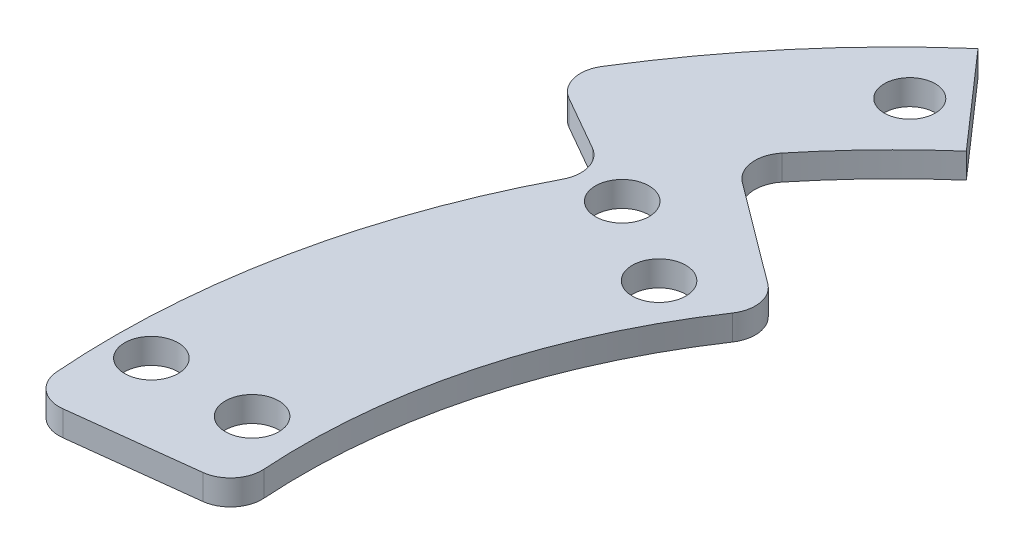
ISO-10303-21;
HEADER;
FILE_DESCRIPTION(('STEP AP214'),'2;1');
FILE_NAME('part.step','',(''),(''),'','','');
FILE_SCHEMA(('AUTOMOTIVE_DESIGN { 1 0 10303 214 1 1 1 1 }'));
ENDSEC;
DATA;
#1=APPLICATION_CONTEXT('core data for automotive mechanical design processes');
#2=APPLICATION_PROTOCOL_DEFINITION('international standard','automotive_design',2000,#1);
#3=PRODUCT_CONTEXT('',#1,'mechanical');
#4=PRODUCT('Part','Part','',(#3));
#5=PRODUCT_RELATED_PRODUCT_CATEGORY('part','',(#4));
#6=PRODUCT_DEFINITION_FORMATION('','',#4);
#7=PRODUCT_DEFINITION_CONTEXT('part definition',#1,'design');
#8=PRODUCT_DEFINITION('design','',#6,#7);
#9=PRODUCT_DEFINITION_SHAPE('','',#8);
#10=(LENGTH_UNIT() NAMED_UNIT(*) SI_UNIT(.MILLI.,.METRE.));
#11=(NAMED_UNIT(*) PLANE_ANGLE_UNIT() SI_UNIT($,.RADIAN.));
#12=(NAMED_UNIT(*) SI_UNIT($,.STERADIAN.) SOLID_ANGLE_UNIT());
#13=UNCERTAINTY_MEASURE_WITH_UNIT(LENGTH_MEASURE(1.E-05),#10,'distance_accuracy_value','');
#14=(GEOMETRIC_REPRESENTATION_CONTEXT(3) GLOBAL_UNCERTAINTY_ASSIGNED_CONTEXT((#13)) GLOBAL_UNIT_ASSIGNED_CONTEXT((#10,
#11,#12)) REPRESENTATION_CONTEXT('',''));
#15=CARTESIAN_POINT('',(0.,0.,0.));
#16=DIRECTION('',(0.,0.,1.));
#17=DIRECTION('',(1.,0.,0.));
#18=AXIS2_PLACEMENT_3D('',#15,#16,#17);
#19=CARTESIAN_POINT('',(-37.6558236064136,2.,-28.1254146373465));
#20=DIRECTION('',(-0.59841307739035,0.,0.801187736306673));
#21=DIRECTION('',(0.801187736306673,0.,0.59841307739035));
#22=AXIS2_PLACEMENT_3D('',#19,#20,#21);
#23=PLANE('',#22);
#24=DIRECTION('',(-0.801187736306673,0.,-0.59841307739035));
#25=VECTOR('',#24,1.);
#26=CARTESIAN_POINT('',(-37.6558236064136,0.,-28.1254146373465));
#27=LINE('',#26,#25);
#28=CARTESIAN_POINT('',(-39.6081806177369,0.,-29.5836446056387));
#29=VERTEX_POINT('',#28);
#30=CARTESIAN_POINT('',(-47.628572534228,0.,-35.5741349628039));
#31=VERTEX_POINT('',#30);
#32=EDGE_CURVE('E216',#29,#31,#27,.T.);
#33=ORIENTED_EDGE('',*,*,#32,.T.);
#34=DIRECTION('',(0.,1.,0.));
#35=VECTOR('',#34,1.);
#36=CARTESIAN_POINT('',(-47.628572534228,2.,-35.5741349628039));
#37=LINE('',#36,#35);
#38=CARTESIAN_POINT('',(-47.628572534228,2.,-35.5741349628039));
#39=VERTEX_POINT('',#38);
#40=EDGE_CURVE('E227',#31,#39,#37,.T.);
#41=ORIENTED_EDGE('',*,*,#40,.T.);
#42=DIRECTION('',(-0.801187736306673,0.,-0.59841307739035));
#43=VECTOR('',#42,1.);
#44=CARTESIAN_POINT('',(-37.6558236064136,2.,-28.1254146373465));
#45=LINE('',#44,#43);
#46=CARTESIAN_POINT('',(-39.6081806177369,2.,-29.5836446056387));
#47=VERTEX_POINT('',#46);
#48=EDGE_CURVE('E206',#47,#39,#45,.T.);
#49=ORIENTED_EDGE('',*,*,#48,.F.);
#50=DIRECTION('',(0.,-1.,0.));
#51=VECTOR('',#50,1.);
#52=CARTESIAN_POINT('',(-39.6081806177369,2.,-29.5836446056387));
#53=LINE('',#52,#51);
#54=EDGE_CURVE('E224',#47,#29,#53,.T.);
#55=ORIENTED_EDGE('',*,*,#54,.T.);
#56=EDGE_LOOP('',(#33,#41,#49,#55));
#57=FACE_BOUND('',#56,.T.);
#58=ADVANCED_FACE('F33',(#57),#23,.F.);
#59=CARTESIAN_POINT('',(0.,2.,0.));
#60=DIRECTION('',(0.,-1.,0.));
#61=DIRECTION('',(0.,0.,-1.));
#62=AXIS2_PLACEMENT_3D('',#59,#60,#61);
#63=CYLINDRICAL_SURFACE('',#62,62.);
#64=CARTESIAN_POINT('',(0.,0.,0.));
#65=DIRECTION('',(0.,1.,0.));
#66=DIRECTION('',(0.,0.,1.));
#67=AXIS2_PLACEMENT_3D('',#64,#65,#66);
#68=CIRCLE('',#67,62.);
#69=CARTESIAN_POINT('',(-54.9771713141222,0.,-28.6620068086248));
#70=VERTEX_POINT('',#69);
#71=CARTESIAN_POINT('',(-61.8215430440958,0.,4.70072501291086));
#72=VERTEX_POINT('',#71);
#73=EDGE_CURVE('E219',#70,#72,#68,.T.);
#74=ORIENTED_EDGE('',*,*,#73,.T.);
#75=DIRECTION('',(0.,-1.,0.));
#76=VECTOR('',#75,1.);
#77=CARTESIAN_POINT('',(-61.8215430440958,2.,4.70072501291086));
#78=LINE('',#77,#76);
#79=CARTESIAN_POINT('',(-61.8215430440958,2.,4.70072501291086));
#80=VERTEX_POINT('',#79);
#81=EDGE_CURVE('E48',#72,#80,#78,.F.);
#82=ORIENTED_EDGE('',*,*,#81,.T.);
#83=CARTESIAN_POINT('',(0.,2.,0.));
#84=DIRECTION('',(0.,1.,0.));
#85=DIRECTION('',(0.,0.,1.));
#86=AXIS2_PLACEMENT_3D('',#83,#84,#85);
#87=CIRCLE('',#86,62.);
#88=CARTESIAN_POINT('',(-54.9771713141222,2.,-28.6620068086248));
#89=VERTEX_POINT('',#88);
#90=EDGE_CURVE('E209',#89,#80,#87,.T.);
#91=ORIENTED_EDGE('',*,*,#90,.F.);
#92=DIRECTION('',(0.,-1.,0.));
#93=VECTOR('',#92,1.);
#94=CARTESIAN_POINT('',(-54.9771713141222,2.,-28.6620068086248));
#95=LINE('',#94,#93);
#96=EDGE_CURVE('E255',#89,#70,#95,.T.);
#97=ORIENTED_EDGE('',*,*,#96,.T.);
#98=EDGE_LOOP('',(#74,#82,#91,#97));
#99=FACE_BOUND('',#98,.T.);
#100=ADVANCED_FACE('F282',(#99),#63,.T.);
#101=CARTESIAN_POINT('',(0.,2.,0.));
#102=DIRECTION('',(0.,1.,0.));
#103=DIRECTION('',(0.,0.,1.));
#104=AXIS2_PLACEMENT_3D('',#101,#102,#103);
#105=PLANE('',#104);
#106=CARTESIAN_POINT('',(-46.7466608615999,2.,-47.9973926197098));
#107=DIRECTION('',(0.,1.,0.));
#108=DIRECTION('',(0.,0.,1.));
#109=AXIS2_PLACEMENT_3D('',#106,#107,#108);
#110=CIRCLE('',#109,2.025);
#111=CARTESIAN_POINT('',(-46.7466608615999,2.,-45.9723926197098));
#112=VERTEX_POINT('',#111);
#113=EDGE_CURVE('E168',#112,#112,#110,.T.);
#114=ORIENTED_EDGE('',*,*,#113,.F.);
#115=EDGE_LOOP('',(#114));
#116=FACE_BOUND('',#115,.T.);
#117=CARTESIAN_POINT('',(-44.1672955930063,2.,-25.5));
#118=DIRECTION('',(0.,1.,0.));
#119=DIRECTION('',(0.,0.,1.));
#120=AXIS2_PLACEMENT_3D('',#117,#118,#119);
#121=CIRCLE('',#120,2.125);
#122=CARTESIAN_POINT('',(-44.1672955930063,2.,-23.375));
#123=VERTEX_POINT('',#122);
#124=EDGE_CURVE('E185',#123,#123,#121,.T.);
#125=ORIENTED_EDGE('',*,*,#124,.F.);
#126=EDGE_LOOP('',(#125));
#127=FACE_BOUND('',#126,.T.);
#128=CARTESIAN_POINT('',(-51.0954988232818,2.,-29.5));
#129=DIRECTION('',(0.,1.,0.));
#130=DIRECTION('',(0.,0.,1.));
#131=AXIS2_PLACEMENT_3D('',#128,#129,#130);
#132=CIRCLE('',#131,2.125);
#133=CARTESIAN_POINT('',(-51.0954988232818,2.,-27.3750000000001));
#134=VERTEX_POINT('',#133);
#135=EDGE_CURVE('E197',#134,#134,#132,.T.);
#136=ORIENTED_EDGE('',*,*,#135,.F.);
#137=EDGE_LOOP('',(#136));
#138=FACE_BOUND('',#137,.T.);
#139=DIRECTION('',(0.993055471537302,0.,-0.117647058823529));
#140=VECTOR('',#139,1.);
#141=CARTESIAN_POINT('',(-46.6736071622532,2.,5.52941176470589));
#142=LINE('',#141,#140);
#143=CARTESIAN_POINT('',(-59.0346212420331,2.,6.99381832833029));
#144=VERTEX_POINT('',#143);
#145=CARTESIAN_POINT('',(-49.0935129154619,2.,5.81609745614508));
#146=VERTEX_POINT('',#145);
#147=EDGE_CURVE('E211',#144,#146,#142,.T.);
#148=ORIENTED_EDGE('',*,*,#147,.T.);
#149=CARTESIAN_POINT('',(-49.3876305625207,2.,3.33345877730183));
#150=DIRECTION('',(0.,1.,0.));
#151=DIRECTION('',(0.,0.,1.));
#152=AXIS2_PLACEMENT_3D('',#149,#150,#151);
#153=CIRCLE('',#152,2.5);
#154=CARTESIAN_POINT('',(-46.8933057866358,2.,3.16510227339769));
#155=VERTEX_POINT('',#154);
#156=EDGE_CURVE('E253',#146,#155,#153,.T.);
#157=ORIENTED_EDGE('',*,*,#156,.T.);
#158=CARTESIAN_POINT('',(0.,2.,0.));
#159=DIRECTION('',(0.,-1.,0.));
#160=DIRECTION('',(0.,0.,1.));
#161=AXIS2_PLACEMENT_3D('',#158,#159,#160);
#162=CIRCLE('',#161,47.);
#163=CARTESIAN_POINT('',(-39.0282429419596,2.,-26.1877118676562));
#164=VERTEX_POINT('',#163);
#165=EDGE_CURVE('E203',#155,#164,#162,.T.);
#166=ORIENTED_EDGE('',*,*,#165,.T.);
#167=CARTESIAN_POINT('',(-41.1042133112127,2.,-27.580675264872));
#168=DIRECTION('',(0.,1.,0.));
#169=DIRECTION('',(0.,0.,1.));
#170=AXIS2_PLACEMENT_3D('',#167,#168,#169);
#171=CIRCLE('',#170,2.5);
#172=EDGE_CURVE('E247',#164,#47,#171,.T.);
#173=ORIENTED_EDGE('',*,*,#172,.T.);
#174=ORIENTED_EDGE('',*,*,#48,.T.);
#175=CARTESIAN_POINT('',(-46.1325398407521,2.,-37.5771043035706));
#176=DIRECTION('',(0.,1.,0.));
#177=DIRECTION('',(0.,0.,1.));
#178=AXIS2_PLACEMENT_3D('',#175,#176,#177);
#179=CIRCLE('',#178,2.5);
#180=CARTESIAN_POINT('',(-48.0708818508677,2.,-39.155974232292));
#181=VERTEX_POINT('',#180);
#182=EDGE_CURVE('E143',#39,#181,#179,.F.);
#183=ORIENTED_EDGE('',*,*,#182,.T.);
#184=CARTESIAN_POINT('',(0.,2.,0.));
#185=DIRECTION('',(0.,1.,0.));
#186=DIRECTION('',(0.,0.,1.));
#187=AXIS2_PLACEMENT_3D('',#184,#185,#186);
#188=CIRCLE('',#187,62.);
#189=CARTESIAN_POINT('',(-40.8742928112385,2.,-46.6185819945345));
#190=VERTEX_POINT('',#189);
#191=EDGE_CURVE('E133',#181,#190,#188,.F.);
#192=ORIENTED_EDGE('',*,*,#191,.T.);
#193=DIRECTION('',(-0.659262787278041,0.,-0.751912612815072));
#194=VECTOR('',#193,1.);
#195=CARTESIAN_POINT('',(-47.4669206840189,2.,-54.1377081226852));
#196=LINE('',#195,#194);
#197=CARTESIAN_POINT('',(-47.4669206840189,2.,-54.1377081226852));
#198=VERTEX_POINT('',#197);
#199=EDGE_CURVE('E140',#190,#198,#196,.T.);
#200=ORIENTED_EDGE('',*,*,#199,.T.);
#201=CARTESIAN_POINT('',(0.,2.,0.));
#202=DIRECTION('',(0.,1.,0.));
#203=DIRECTION('',(0.,0.,1.));
#204=AXIS2_PLACEMENT_3D('',#201,#202,#203);
#205=CIRCLE('',#204,72.);
#206=CARTESIAN_POINT('',(-61.1805031232971,2.,-37.9597950149923));
#207=VERTEX_POINT('',#206);
#208=EDGE_CURVE('E175',#198,#207,#205,.T.);
#209=ORIENTED_EDGE('',*,*,#208,.T.);
#210=CARTESIAN_POINT('',(-59.0561800981826,2.,-36.6417465769717));
#211=DIRECTION('',(0.,1.,0.));
#212=DIRECTION('',(0.,0.,1.));
#213=AXIS2_PLACEMENT_3D('',#210,#211,#212);
#214=CIRCLE('',#213,2.5);
#215=CARTESIAN_POINT('',(-60.2969610324018,2.,-34.4713865438716));
#216=VERTEX_POINT('',#215);
#217=EDGE_CURVE('E249',#207,#216,#214,.T.);
#218=ORIENTED_EDGE('',*,*,#217,.T.);
#219=DIRECTION('',(0.868144013240027,0.,0.496312373687681));
#220=VECTOR('',#219,1.);
#221=CARTESIAN_POINT('',(-62.5063689532819,2.,-35.734490905513));
#222=LINE('',#221,#220);
#223=CARTESIAN_POINT('',(-55.9532118038596,2.,-31.9880929227178));
#224=VERTEX_POINT('',#223);
#225=EDGE_CURVE('E172',#216,#224,#222,.T.);
#226=ORIENTED_EDGE('',*,*,#225,.T.);
#227=CARTESIAN_POINT('',(-57.1939927380788,2.,-29.8177328896178));
#228=DIRECTION('',(0.,1.,0.));
#229=DIRECTION('',(0.,0.,1.));
#230=AXIS2_PLACEMENT_3D('',#227,#228,#229);
#231=CIRCLE('',#230,2.5);
#232=EDGE_CURVE('E11',#224,#89,#231,.F.);
#233=ORIENTED_EDGE('',*,*,#232,.T.);
#234=ORIENTED_EDGE('',*,*,#90,.T.);
#235=CARTESIAN_POINT('',(-59.328738889092,2.,4.51117964948704));
#236=DIRECTION('',(0.,1.,0.));
#237=DIRECTION('',(0.,0.,1.));
#238=AXIS2_PLACEMENT_3D('',#235,#236,#237);
#239=CIRCLE('',#238,2.5);
#240=EDGE_CURVE('E251',#80,#144,#239,.T.);
#241=ORIENTED_EDGE('',*,*,#240,.T.);
#242=EDGE_LOOP('',(#148,#157,#166,#173,#174,#183,#192,#200,#209,#218,#226,#233,#234,#241));
#243=FACE_BOUND('',#242,.T.);
#244=CARTESIAN_POINT('',(-59.,2.,0.));
#245=DIRECTION('',(0.,1.,0.));
#246=DIRECTION('',(0.,0.,1.));
#247=AXIS2_PLACEMENT_3D('',#244,#245,#246);
#248=CIRCLE('',#247,2.125);
#249=CARTESIAN_POINT('',(-59.,2.,2.12500000000001));
#250=VERTEX_POINT('',#249);
#251=EDGE_CURVE('E191',#250,#250,#248,.T.);
#252=ORIENTED_EDGE('',*,*,#251,.F.);
#253=EDGE_LOOP('',(#252));
#254=FACE_BOUND('',#253,.T.);
#255=CARTESIAN_POINT('',(-51.,2.,0.));
#256=DIRECTION('',(0.,1.,0.));
#257=DIRECTION('',(0.,0.,1.));
#258=AXIS2_PLACEMENT_3D('',#255,#256,#257);
#259=CIRCLE('',#258,2.125);
#260=CARTESIAN_POINT('',(-51.,2.,2.12500000000001));
#261=VERTEX_POINT('',#260);
#262=EDGE_CURVE('E179',#261,#261,#259,.T.);
#263=ORIENTED_EDGE('',*,*,#262,.F.);
#264=EDGE_LOOP('',(#263));
#265=FACE_BOUND('',#264,.T.);
#266=ADVANCED_FACE('F136',(#116,#127,#138,#243,#254,#265),#105,.T.);
#267=CARTESIAN_POINT('',(0.,0.,0.));
#268=DIRECTION('',(0.,1.,0.));
#269=DIRECTION('',(0.,0.,1.));
#270=AXIS2_PLACEMENT_3D('',#267,#268,#269);
#271=PLANE('',#270);
#272=CARTESIAN_POINT('',(-46.7466608615999,0.,-47.9973926197098));
#273=DIRECTION('',(0.,1.,0.));
#274=DIRECTION('',(0.,0.,1.));
#275=AXIS2_PLACEMENT_3D('',#272,#273,#274);
#276=CIRCLE('',#275,2.025);
#277=CARTESIAN_POINT('',(-46.7466608615999,0.,-45.9723926197098));
#278=VERTEX_POINT('',#277);
#279=EDGE_CURVE('E373',#278,#278,#276,.T.);
#280=ORIENTED_EDGE('',*,*,#279,.T.);
#281=EDGE_LOOP('',(#280));
#282=FACE_BOUND('',#281,.T.);
#283=CARTESIAN_POINT('',(0.,0.,0.));
#284=DIRECTION('',(0.,-1.,0.));
#285=DIRECTION('',(0.,0.,1.));
#286=AXIS2_PLACEMENT_3D('',#283,#284,#285);
#287=CIRCLE('',#286,47.);
#288=CARTESIAN_POINT('',(-46.8933057866358,0.,3.16510227339769));
#289=VERTEX_POINT('',#288);
#290=CARTESIAN_POINT('',(-39.0282429419596,0.,-26.1877118676562));
#291=VERTEX_POINT('',#290);
#292=EDGE_CURVE('E200',#289,#291,#287,.T.);
#293=ORIENTED_EDGE('',*,*,#292,.F.);
#294=CARTESIAN_POINT('',(-49.3876305625207,0.,3.33345877730183));
#295=DIRECTION('',(0.,1.,0.));
#296=DIRECTION('',(0.,0.,1.));
#297=AXIS2_PLACEMENT_3D('',#294,#295,#296);
#298=CIRCLE('',#297,2.5);
#299=CARTESIAN_POINT('',(-49.0935129154619,0.,5.81609745614508));
#300=VERTEX_POINT('',#299);
#301=EDGE_CURVE('E240',#289,#300,#298,.F.);
#302=ORIENTED_EDGE('',*,*,#301,.T.);
#303=DIRECTION('',(0.993055471537302,0.,-0.117647058823529));
#304=VECTOR('',#303,1.);
#305=CARTESIAN_POINT('',(-46.6736071622532,0.,5.52941176470589));
#306=LINE('',#305,#304);
#307=CARTESIAN_POINT('',(-59.0346212420331,0.,6.99381832833029));
#308=VERTEX_POINT('',#307);
#309=EDGE_CURVE('E207',#308,#300,#306,.T.);
#310=ORIENTED_EDGE('',*,*,#309,.F.);
#311=CARTESIAN_POINT('',(-59.328738889092,0.,4.51117964948704));
#312=DIRECTION('',(0.,1.,0.));
#313=DIRECTION('',(0.,0.,1.));
#314=AXIS2_PLACEMENT_3D('',#311,#312,#313);
#315=CIRCLE('',#314,2.5);
#316=EDGE_CURVE('E238',#308,#72,#315,.F.);
#317=ORIENTED_EDGE('',*,*,#316,.T.);
#318=ORIENTED_EDGE('',*,*,#73,.F.);
#319=CARTESIAN_POINT('',(-57.1939927380788,0.,-29.8177328896178));
#320=DIRECTION('',(0.,1.,0.));
#321=DIRECTION('',(0.,0.,1.));
#322=AXIS2_PLACEMENT_3D('',#319,#320,#321);
#323=CIRCLE('',#322,2.5);
#324=CARTESIAN_POINT('',(-55.9532118038596,0.,-31.9880929227178));
#325=VERTEX_POINT('',#324);
#326=EDGE_CURVE('E41',#70,#325,#323,.T.);
#327=ORIENTED_EDGE('',*,*,#326,.T.);
#328=DIRECTION('',(0.868144013240027,0.,0.496312373687681));
#329=VECTOR('',#328,1.);
#330=CARTESIAN_POINT('',(-62.5063689532819,0.,-35.734490905513));
#331=LINE('',#330,#329);
#332=CARTESIAN_POINT('',(-60.2969610324018,0.,-34.4713865438716));
#333=VERTEX_POINT('',#332);
#334=EDGE_CURVE('E169',#333,#325,#331,.T.);
#335=ORIENTED_EDGE('',*,*,#334,.F.);
#336=CARTESIAN_POINT('',(-59.0561800981826,0.,-36.6417465769717));
#337=DIRECTION('',(0.,1.,0.));
#338=DIRECTION('',(0.,0.,1.));
#339=AXIS2_PLACEMENT_3D('',#336,#337,#338);
#340=CIRCLE('',#339,2.5);
#341=CARTESIAN_POINT('',(-61.1805031232971,0.,-37.9597950149923));
#342=VERTEX_POINT('',#341);
#343=EDGE_CURVE('E236',#333,#342,#340,.F.);
#344=ORIENTED_EDGE('',*,*,#343,.T.);
#345=CARTESIAN_POINT('',(0.,0.,0.));
#346=DIRECTION('',(0.,1.,0.));
#347=DIRECTION('',(0.,0.,-1.));
#348=AXIS2_PLACEMENT_3D('',#345,#346,#347);
#349=CIRCLE('',#348,72.);
#350=CARTESIAN_POINT('',(-47.4669206840189,0.,-54.1377081226852));
#351=VERTEX_POINT('',#350);
#352=EDGE_CURVE('E147',#351,#342,#349,.T.);
#353=ORIENTED_EDGE('',*,*,#352,.F.);
#354=DIRECTION('',(-0.659262787278041,0.,-0.751912612815072));
#355=VECTOR('',#354,1.);
#356=CARTESIAN_POINT('',(-47.4669206840189,0.,-54.1377081226852));
#357=LINE('',#356,#355);
#358=CARTESIAN_POINT('',(-40.8742928112385,0.,-46.6185819945345));
#359=VERTEX_POINT('',#358);
#360=EDGE_CURVE('E157',#359,#351,#357,.T.);
#361=ORIENTED_EDGE('',*,*,#360,.F.);
#362=CARTESIAN_POINT('',(0.,0.,0.));
#363=DIRECTION('',(0.,-1.,0.));
#364=DIRECTION('',(0.,0.,1.));
#365=AXIS2_PLACEMENT_3D('',#362,#363,#364);
#366=CIRCLE('',#365,62.);
#367=CARTESIAN_POINT('',(-48.0708818508677,0.,-39.155974232292));
#368=VERTEX_POINT('',#367);
#369=EDGE_CURVE('E153',#368,#359,#366,.T.);
#370=ORIENTED_EDGE('',*,*,#369,.F.);
#371=CARTESIAN_POINT('',(-46.1325398407521,0.,-37.5771043035706));
#372=DIRECTION('',(0.,1.,0.));
#373=DIRECTION('',(0.,0.,1.));
#374=AXIS2_PLACEMENT_3D('',#371,#372,#373);
#375=CIRCLE('',#374,2.5);
#376=EDGE_CURVE('E266',#368,#31,#375,.T.);
#377=ORIENTED_EDGE('',*,*,#376,.T.);
#378=ORIENTED_EDGE('',*,*,#32,.F.);
#379=CARTESIAN_POINT('',(-41.1042133112127,0.,-27.580675264872));
#380=DIRECTION('',(0.,1.,0.));
#381=DIRECTION('',(0.,0.,1.));
#382=AXIS2_PLACEMENT_3D('',#379,#380,#381);
#383=CIRCLE('',#382,2.5);
#384=EDGE_CURVE('E234',#29,#291,#383,.F.);
#385=ORIENTED_EDGE('',*,*,#384,.T.);
#386=EDGE_LOOP('',(#293,#302,#310,#317,#318,#327,#335,#344,#353,#361,#370,#377,#378,#385));
#387=FACE_BOUND('',#386,.T.);
#388=CARTESIAN_POINT('',(-51.0954988232818,0.,-29.5));
#389=DIRECTION('',(0.,1.,0.));
#390=DIRECTION('',(0.,0.,1.));
#391=AXIS2_PLACEMENT_3D('',#388,#389,#390);
#392=CIRCLE('',#391,2.125);
#393=CARTESIAN_POINT('',(-51.0954988232818,0.,-27.3750000000001));
#394=VERTEX_POINT('',#393);
#395=EDGE_CURVE('E194',#394,#394,#392,.T.);
#396=ORIENTED_EDGE('',*,*,#395,.T.);
#397=EDGE_LOOP('',(#396));
#398=FACE_BOUND('',#397,.T.);
#399=CARTESIAN_POINT('',(-59.,0.,0.));
#400=DIRECTION('',(0.,1.,0.));
#401=DIRECTION('',(0.,0.,1.));
#402=AXIS2_PLACEMENT_3D('',#399,#400,#401);
#403=CIRCLE('',#402,2.125);
#404=CARTESIAN_POINT('',(-59.,0.,2.12500000000001));
#405=VERTEX_POINT('',#404);
#406=EDGE_CURVE('E188',#405,#405,#403,.T.);
#407=ORIENTED_EDGE('',*,*,#406,.T.);
#408=EDGE_LOOP('',(#407));
#409=FACE_BOUND('',#408,.T.);
#410=CARTESIAN_POINT('',(-44.1672955930063,0.,-25.5));
#411=DIRECTION('',(0.,1.,0.));
#412=DIRECTION('',(0.,0.,1.));
#413=AXIS2_PLACEMENT_3D('',#410,#411,#412);
#414=CIRCLE('',#413,2.125);
#415=CARTESIAN_POINT('',(-44.1672955930063,0.,-23.375));
#416=VERTEX_POINT('',#415);
#417=EDGE_CURVE('E182',#416,#416,#414,.T.);
#418=ORIENTED_EDGE('',*,*,#417,.T.);
#419=EDGE_LOOP('',(#418));
#420=FACE_BOUND('',#419,.T.);
#421=CARTESIAN_POINT('',(-51.,0.,0.));
#422=DIRECTION('',(0.,1.,0.));
#423=DIRECTION('',(0.,0.,1.));
#424=AXIS2_PLACEMENT_3D('',#421,#422,#423);
#425=CIRCLE('',#424,2.125);
#426=CARTESIAN_POINT('',(-51.,0.,2.12500000000001));
#427=VERTEX_POINT('',#426);
#428=EDGE_CURVE('E177',#427,#427,#425,.T.);
#429=ORIENTED_EDGE('',*,*,#428,.T.);
#430=EDGE_LOOP('',(#429));
#431=FACE_BOUND('',#430,.T.);
#432=ADVANCED_FACE('F272',(#282,#387,#398,#409,#420,#431),#271,.F.);
#433=CARTESIAN_POINT('',(0.,2.,0.));
#434=DIRECTION('',(0.,-1.,0.));
#435=DIRECTION('',(0.,0.,-1.));
#436=AXIS2_PLACEMENT_3D('',#433,#434,#435);
#437=CYLINDRICAL_SURFACE('',#436,47.);
#438=ORIENTED_EDGE('',*,*,#165,.F.);
#439=DIRECTION('',(0.,-1.,0.));
#440=VECTOR('',#439,1.);
#441=CARTESIAN_POINT('',(-46.8933057866358,2.,3.16510227339769));
#442=LINE('',#441,#440);
#443=EDGE_CURVE('E231',#155,#289,#442,.T.);
#444=ORIENTED_EDGE('',*,*,#443,.T.);
#445=ORIENTED_EDGE('',*,*,#292,.T.);
#446=DIRECTION('',(0.,-1.,0.));
#447=VECTOR('',#446,1.);
#448=CARTESIAN_POINT('',(-39.0282429419596,2.,-26.1877118676562));
#449=LINE('',#448,#447);
#450=EDGE_CURVE('E229',#291,#164,#449,.F.);
#451=ORIENTED_EDGE('',*,*,#450,.T.);
#452=EDGE_LOOP('',(#438,#444,#445,#451));
#453=FACE_BOUND('',#452,.T.);
#454=ADVANCED_FACE('F298',(#453),#437,.F.);
#455=CARTESIAN_POINT('',(-46.6736071622532,2.,5.52941176470589));
#456=DIRECTION('',(-0.117647058823529,0.,-0.993055471537302));
#457=DIRECTION('',(-0.993055471537302,0.,0.117647058823529));
#458=AXIS2_PLACEMENT_3D('',#455,#456,#457);
#459=PLANE('',#458);
#460=ORIENTED_EDGE('',*,*,#309,.T.);
#461=DIRECTION('',(0.,-1.,0.));
#462=VECTOR('',#461,1.);
#463=CARTESIAN_POINT('',(-49.0935129154619,2.,5.81609745614508));
#464=LINE('',#463,#462);
#465=EDGE_CURVE('E245',#300,#146,#464,.F.);
#466=ORIENTED_EDGE('',*,*,#465,.T.);
#467=ORIENTED_EDGE('',*,*,#147,.F.);
#468=DIRECTION('',(0.,-1.,0.));
#469=VECTOR('',#468,1.);
#470=CARTESIAN_POINT('',(-59.0346212420331,2.,6.99381832833029));
#471=LINE('',#470,#469);
#472=EDGE_CURVE('E242',#144,#308,#471,.T.);
#473=ORIENTED_EDGE('',*,*,#472,.T.);
#474=EDGE_LOOP('',(#460,#466,#467,#473));
#475=FACE_BOUND('',#474,.T.);
#476=ADVANCED_FACE('F290',(#475),#459,.F.);
#477=CARTESIAN_POINT('',(-51.0954988232818,2.,-29.5));
#478=DIRECTION('',(0.,-1.,0.));
#479=DIRECTION('',(0.,0.,-1.));
#480=AXIS2_PLACEMENT_3D('',#477,#478,#479);
#481=CYLINDRICAL_SURFACE('',#480,2.125);
#482=ORIENTED_EDGE('',*,*,#135,.T.);
#483=EDGE_LOOP('',(#482));
#484=FACE_BOUND('',#483,.T.);
#485=ORIENTED_EDGE('',*,*,#395,.F.);
#486=EDGE_LOOP('',(#485));
#487=FACE_BOUND('',#486,.T.);
#488=ADVANCED_FACE('F330',(#484,#487),#481,.F.);
#489=CARTESIAN_POINT('',(-59.,2.,0.));
#490=DIRECTION('',(0.,-1.,0.));
#491=DIRECTION('',(0.,0.,-1.));
#492=AXIS2_PLACEMENT_3D('',#489,#490,#491);
#493=CYLINDRICAL_SURFACE('',#492,2.125);
#494=ORIENTED_EDGE('',*,*,#251,.T.);
#495=EDGE_LOOP('',(#494));
#496=FACE_BOUND('',#495,.T.);
#497=ORIENTED_EDGE('',*,*,#406,.F.);
#498=EDGE_LOOP('',(#497));
#499=FACE_BOUND('',#498,.T.);
#500=ADVANCED_FACE('F342',(#496,#499),#493,.F.);
#501=CARTESIAN_POINT('',(-44.1672955930063,2.,-25.5));
#502=DIRECTION('',(0.,-1.,0.));
#503=DIRECTION('',(0.,0.,-1.));
#504=AXIS2_PLACEMENT_3D('',#501,#502,#503);
#505=CYLINDRICAL_SURFACE('',#504,2.125);
#506=ORIENTED_EDGE('',*,*,#124,.T.);
#507=EDGE_LOOP('',(#506));
#508=FACE_BOUND('',#507,.T.);
#509=ORIENTED_EDGE('',*,*,#417,.F.);
#510=EDGE_LOOP('',(#509));
#511=FACE_BOUND('',#510,.T.);
#512=ADVANCED_FACE('F346',(#508,#511),#505,.F.);
#513=CARTESIAN_POINT('',(-51.,2.,0.));
#514=DIRECTION('',(0.,-1.,0.));
#515=DIRECTION('',(0.,0.,-1.));
#516=AXIS2_PLACEMENT_3D('',#513,#514,#515);
#517=CYLINDRICAL_SURFACE('',#516,2.125);
#518=ORIENTED_EDGE('',*,*,#262,.T.);
#519=EDGE_LOOP('',(#518));
#520=FACE_BOUND('',#519,.T.);
#521=ORIENTED_EDGE('',*,*,#428,.F.);
#522=EDGE_LOOP('',(#521));
#523=FACE_BOUND('',#522,.T.);
#524=ADVANCED_FACE('F350',(#520,#523),#517,.F.);
#525=CARTESIAN_POINT('',(0.,19.7854648039939,0.));
#526=DIRECTION('',(0.,-1.,0.));
#527=DIRECTION('',(0.,0.,-1.));
#528=AXIS2_PLACEMENT_3D('',#525,#526,#527);
#529=CYLINDRICAL_SURFACE('',#528,72.);
#530=ORIENTED_EDGE('',*,*,#352,.T.);
#531=DIRECTION('',(0.,-1.,0.));
#532=VECTOR('',#531,1.);
#533=CARTESIAN_POINT('',(-61.1805031232971,19.7854648039939,-37.9597950149923));
#534=LINE('',#533,#532);
#535=EDGE_CURVE('E264',#342,#207,#534,.F.);
#536=ORIENTED_EDGE('',*,*,#535,.T.);
#537=ORIENTED_EDGE('',*,*,#208,.F.);
#538=DIRECTION('',(0.,-1.,0.));
#539=VECTOR('',#538,1.);
#540=CARTESIAN_POINT('',(-47.4669206840189,25.9341987801449,-54.1377081226852));
#541=LINE('',#540,#539);
#542=EDGE_CURVE('E162',#198,#351,#541,.T.);
#543=ORIENTED_EDGE('',*,*,#542,.T.);
#544=EDGE_LOOP('',(#530,#536,#537,#543));
#545=FACE_BOUND('',#544,.T.);
#546=ADVANCED_FACE('F354',(#545),#529,.T.);
#547=CARTESIAN_POINT('',(-62.5063689532819,19.7854648039939,-35.734490905513));
#548=DIRECTION('',(0.496312373687681,0.,-0.868144013240027));
#549=DIRECTION('',(-0.868144013240027,0.,-0.496312373687681));
#550=AXIS2_PLACEMENT_3D('',#547,#548,#549);
#551=PLANE('',#550);
#552=ORIENTED_EDGE('',*,*,#225,.F.);
#553=DIRECTION('',(0.,-1.,0.));
#554=VECTOR('',#553,1.);
#555=CARTESIAN_POINT('',(-60.2969610324018,19.7854648039939,-34.4713865438716));
#556=LINE('',#555,#554);
#557=EDGE_CURVE('E261',#216,#333,#556,.T.);
#558=ORIENTED_EDGE('',*,*,#557,.T.);
#559=ORIENTED_EDGE('',*,*,#334,.T.);
#560=DIRECTION('',(0.,1.,0.));
#561=VECTOR('',#560,1.);
#562=CARTESIAN_POINT('',(-55.9532118038596,2.,-31.9880929227178));
#563=LINE('',#562,#561);
#564=EDGE_CURVE('E259',#325,#224,#563,.T.);
#565=ORIENTED_EDGE('',*,*,#564,.T.);
#566=EDGE_LOOP('',(#552,#558,#559,#565));
#567=FACE_BOUND('',#566,.T.);
#568=ADVANCED_FACE('F279',(#567),#551,.F.);
#569=CARTESIAN_POINT('',(0.,25.9341987801449,0.));
#570=DIRECTION('',(0.,-1.,0.));
#571=DIRECTION('',(0.,0.,-1.));
#572=AXIS2_PLACEMENT_3D('',#569,#570,#571);
#573=CYLINDRICAL_SURFACE('',#572,62.);
#574=ORIENTED_EDGE('',*,*,#191,.F.);
#575=DIRECTION('',(0.,-1.,0.));
#576=VECTOR('',#575,1.);
#577=CARTESIAN_POINT('',(-48.0708818508677,25.9341987801449,-39.155974232292));
#578=LINE('',#577,#576);
#579=EDGE_CURVE('E213',#181,#368,#578,.T.);
#580=ORIENTED_EDGE('',*,*,#579,.T.);
#581=ORIENTED_EDGE('',*,*,#369,.T.);
#582=DIRECTION('',(0.,-1.,0.));
#583=VECTOR('',#582,1.);
#584=CARTESIAN_POINT('',(-40.8742928112385,25.9341987801449,-46.6185819945345));
#585=LINE('',#584,#583);
#586=EDGE_CURVE('E150',#190,#359,#585,.T.);
#587=ORIENTED_EDGE('',*,*,#586,.F.);
#588=EDGE_LOOP('',(#574,#580,#581,#587));
#589=FACE_BOUND('',#588,.T.);
#590=ADVANCED_FACE('F151',(#589),#573,.F.);
#591=CARTESIAN_POINT('',(-47.4669206840189,25.9341987801449,-54.1377081226852));
#592=DIRECTION('',(-0.751912612815072,0.,0.659262787278041));
#593=DIRECTION('',(0.659262787278041,0.,0.751912612815072));
#594=AXIS2_PLACEMENT_3D('',#591,#592,#593);
#595=PLANE('',#594);
#596=ORIENTED_EDGE('',*,*,#199,.F.);
#597=ORIENTED_EDGE('',*,*,#586,.T.);
#598=ORIENTED_EDGE('',*,*,#360,.T.);
#599=ORIENTED_EDGE('',*,*,#542,.F.);
#600=EDGE_LOOP('',(#596,#597,#598,#599));
#601=FACE_BOUND('',#600,.T.);
#602=ADVANCED_FACE('F160',(#601),#595,.F.);
#603=CARTESIAN_POINT('',(-46.1325398407521,25.9341987801449,-37.5771043035706));
#604=DIRECTION('',(0.,-1.,0.));
#605=DIRECTION('',(0.,0.,-1.));
#606=AXIS2_PLACEMENT_3D('',#603,#604,#605);
#607=CYLINDRICAL_SURFACE('',#606,2.5);
#608=ORIENTED_EDGE('',*,*,#182,.F.);
#609=ORIENTED_EDGE('',*,*,#40,.F.);
#610=ORIENTED_EDGE('',*,*,#376,.F.);
#611=ORIENTED_EDGE('',*,*,#579,.F.);
#612=EDGE_LOOP('',(#608,#609,#610,#611));
#613=FACE_BOUND('',#612,.T.);
#614=ADVANCED_FACE('F308',(#613),#607,.F.);
#615=CARTESIAN_POINT('',(-49.3876305625207,2.,3.33345877730183));
#616=DIRECTION('',(0.,-1.,0.));
#617=DIRECTION('',(0.,0.,-1.));
#618=AXIS2_PLACEMENT_3D('',#615,#616,#617);
#619=CYLINDRICAL_SURFACE('',#618,2.5);
#620=ORIENTED_EDGE('',*,*,#156,.F.);
#621=ORIENTED_EDGE('',*,*,#465,.F.);
#622=ORIENTED_EDGE('',*,*,#301,.F.);
#623=ORIENTED_EDGE('',*,*,#443,.F.);
#624=EDGE_LOOP('',(#620,#621,#622,#623));
#625=FACE_BOUND('',#624,.T.);
#626=ADVANCED_FACE('F295',(#625),#619,.T.);
#627=CARTESIAN_POINT('',(-59.328738889092,2.,4.51117964948704));
#628=DIRECTION('',(0.,-1.,0.));
#629=DIRECTION('',(0.,0.,-1.));
#630=AXIS2_PLACEMENT_3D('',#627,#628,#629);
#631=CYLINDRICAL_SURFACE('',#630,2.5);
#632=ORIENTED_EDGE('',*,*,#240,.F.);
#633=ORIENTED_EDGE('',*,*,#81,.F.);
#634=ORIENTED_EDGE('',*,*,#316,.F.);
#635=ORIENTED_EDGE('',*,*,#472,.F.);
#636=EDGE_LOOP('',(#632,#633,#634,#635));
#637=FACE_BOUND('',#636,.T.);
#638=ADVANCED_FACE('F287',(#637),#631,.T.);
#639=CARTESIAN_POINT('',(-59.0561800981826,19.7854648039939,-36.6417465769717));
#640=DIRECTION('',(0.,-1.,0.));
#641=DIRECTION('',(0.,0.,-1.));
#642=AXIS2_PLACEMENT_3D('',#639,#640,#641);
#643=CYLINDRICAL_SURFACE('',#642,2.5);
#644=ORIENTED_EDGE('',*,*,#217,.F.);
#645=ORIENTED_EDGE('',*,*,#535,.F.);
#646=ORIENTED_EDGE('',*,*,#343,.F.);
#647=ORIENTED_EDGE('',*,*,#557,.F.);
#648=EDGE_LOOP('',(#644,#645,#646,#647));
#649=FACE_BOUND('',#648,.T.);
#650=ADVANCED_FACE('F394',(#649),#643,.T.);
#651=CARTESIAN_POINT('',(-57.1939927380788,2.,-29.8177328896178));
#652=DIRECTION('',(0.,-1.,0.));
#653=DIRECTION('',(0.,0.,-1.));
#654=AXIS2_PLACEMENT_3D('',#651,#652,#653);
#655=CYLINDRICAL_SURFACE('',#654,2.5);
#656=ORIENTED_EDGE('',*,*,#232,.F.);
#657=ORIENTED_EDGE('',*,*,#564,.F.);
#658=ORIENTED_EDGE('',*,*,#326,.F.);
#659=ORIENTED_EDGE('',*,*,#96,.F.);
#660=EDGE_LOOP('',(#656,#657,#658,#659));
#661=FACE_BOUND('',#660,.T.);
#662=ADVANCED_FACE('F281',(#661),#655,.F.);
#663=CARTESIAN_POINT('',(-41.1042133112127,2.,-27.580675264872));
#664=DIRECTION('',(0.,-1.,0.));
#665=DIRECTION('',(0.,0.,-1.));
#666=AXIS2_PLACEMENT_3D('',#663,#664,#665);
#667=CYLINDRICAL_SURFACE('',#666,2.5);
#668=ORIENTED_EDGE('',*,*,#172,.F.);
#669=ORIENTED_EDGE('',*,*,#450,.F.);
#670=ORIENTED_EDGE('',*,*,#384,.F.);
#671=ORIENTED_EDGE('',*,*,#54,.F.);
#672=EDGE_LOOP('',(#668,#669,#670,#671));
#673=FACE_BOUND('',#672,.T.);
#674=ADVANCED_FACE('F35',(#673),#667,.T.);
#675=CARTESIAN_POINT('',(-46.7466608615999,0.,-47.9973926197098));
#676=DIRECTION('',(0.,1.,0.));
#677=DIRECTION('',(0.,0.,1.));
#678=AXIS2_PLACEMENT_3D('',#675,#676,#677);
#679=CYLINDRICAL_SURFACE('',#678,2.025);
#680=ORIENTED_EDGE('',*,*,#113,.T.);
#681=EDGE_LOOP('',(#680));
#682=FACE_BOUND('',#681,.T.);
#683=ORIENTED_EDGE('',*,*,#279,.F.);
#684=EDGE_LOOP('',(#683));
#685=FACE_BOUND('',#684,.T.);
#686=ADVANCED_FACE('F363',(#682,#685),#679,.F.);
#687=CLOSED_SHELL('',(#58,#100,#266,#432,#454,#476,#488,#500,#512,#524,#546,#568,#590,#602,#614,
#626,#638,#650,#662,#674,#686));
#688=MANIFOLD_SOLID_BREP('B2',#687);
#689=ADVANCED_BREP_SHAPE_REPRESENTATION('',(#18,#688),#14);
#690=SHAPE_DEFINITION_REPRESENTATION(#9,#689);
ENDSEC;
END-ISO-10303-21;
